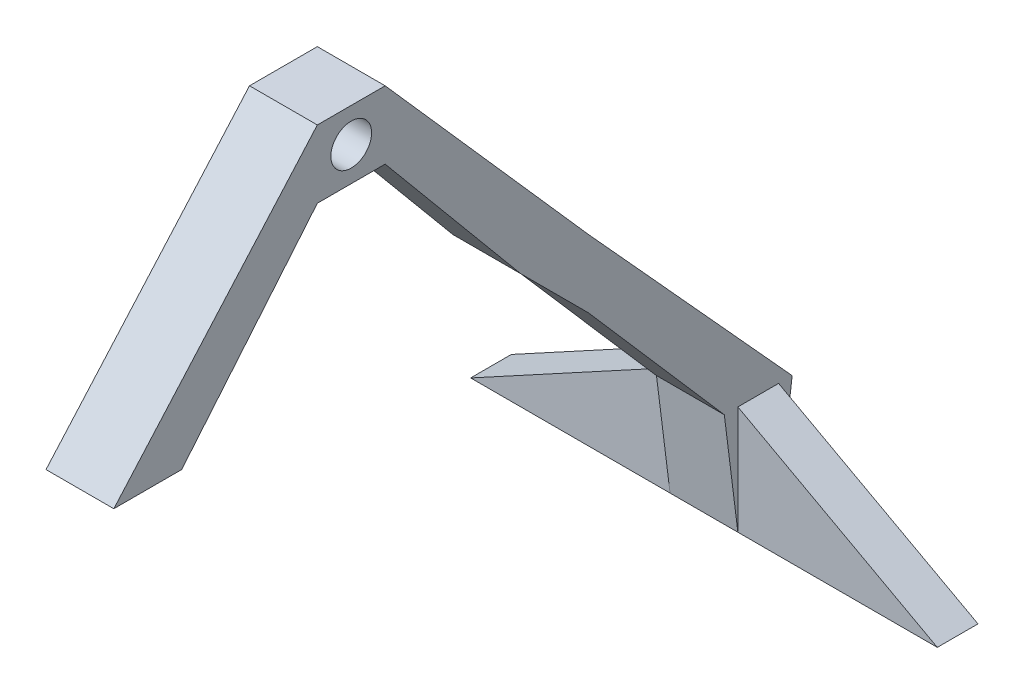
ISO-10303-21;
HEADER;
FILE_DESCRIPTION(('STEP AP214'),'2;1');
FILE_NAME('part.step','',(''),(''),'','','');
FILE_SCHEMA(('AUTOMOTIVE_DESIGN { 1 0 10303 214 1 1 1 1 }'));
ENDSEC;
DATA;
#1=APPLICATION_CONTEXT('core data for automotive mechanical design processes');
#2=APPLICATION_PROTOCOL_DEFINITION('international standard','automotive_design',2000,#1);
#3=PRODUCT_CONTEXT('',#1,'mechanical');
#4=PRODUCT('Part','Part','',(#3));
#5=PRODUCT_RELATED_PRODUCT_CATEGORY('part','',(#4));
#6=PRODUCT_DEFINITION_FORMATION('','',#4);
#7=PRODUCT_DEFINITION_CONTEXT('part definition',#1,'design');
#8=PRODUCT_DEFINITION('design','',#6,#7);
#9=PRODUCT_DEFINITION_SHAPE('','',#8);
#10=(LENGTH_UNIT() NAMED_UNIT(*) SI_UNIT(.MILLI.,.METRE.));
#11=(NAMED_UNIT(*) PLANE_ANGLE_UNIT() SI_UNIT($,.RADIAN.));
#12=(NAMED_UNIT(*) SI_UNIT($,.STERADIAN.) SOLID_ANGLE_UNIT());
#13=UNCERTAINTY_MEASURE_WITH_UNIT(LENGTH_MEASURE(1.E-05),#10,'distance_accuracy_value','');
#14=(GEOMETRIC_REPRESENTATION_CONTEXT(3) GLOBAL_UNCERTAINTY_ASSIGNED_CONTEXT((#13)) GLOBAL_UNIT_ASSIGNED_CONTEXT((#10,
#11,#12)) REPRESENTATION_CONTEXT('',''));
#15=CARTESIAN_POINT('',(0.,0.,0.));
#16=DIRECTION('',(0.,0.,1.));
#17=DIRECTION('',(1.,0.,0.));
#18=AXIS2_PLACEMENT_3D('',#15,#16,#17);
#19=CARTESIAN_POINT('',(0.,0.,0.));
#20=DIRECTION('',(0.,1.,0.));
#21=DIRECTION('',(0.,0.,1.));
#22=AXIS2_PLACEMENT_3D('',#19,#20,#21);
#23=PLANE('',#22);
#24=DIRECTION('',(-1.,0.,0.));
#25=VECTOR('',#24,1.);
#26=CARTESIAN_POINT('',(86.0010000000001,0.,7.5));
#27=LINE('',#26,#25);
#28=CARTESIAN_POINT('',(12.5000000000001,0.,7.5));
#29=VERTEX_POINT('',#28);
#30=CARTESIAN_POINT('',(-12.4999999999999,0.,7.5));
#31=VERTEX_POINT('',#30);
#32=EDGE_CURVE('E344',#29,#31,#27,.T.);
#33=ORIENTED_EDGE('',*,*,#32,.T.);
#34=DIRECTION('',(1.,0.,0.));
#35=VECTOR('',#34,1.);
#36=CARTESIAN_POINT('',(0.,0.,7.5));
#37=LINE('',#36,#35);
#38=CARTESIAN_POINT('',(-85.9999999999999,0.,7.5));
#39=VERTEX_POINT('',#38);
#40=EDGE_CURVE('E360',#39,#31,#37,.T.);
#41=ORIENTED_EDGE('',*,*,#40,.F.);
#42=DIRECTION('',(0.,0.,1.));
#43=VECTOR('',#42,1.);
#44=CARTESIAN_POINT('',(-85.9999999999999,0.,0.));
#45=LINE('',#44,#43);
#46=CARTESIAN_POINT('',(-85.9999999999999,0.,-7.5));
#47=VERTEX_POINT('',#46);
#48=EDGE_CURVE('E376',#47,#39,#45,.T.);
#49=ORIENTED_EDGE('',*,*,#48,.F.);
#50=DIRECTION('',(1.,0.,0.));
#51=VECTOR('',#50,1.);
#52=CARTESIAN_POINT('',(0.,0.,-7.5));
#53=LINE('',#52,#51);
#54=CARTESIAN_POINT('',(-12.4999999999999,0.,-7.5));
#55=VERTEX_POINT('',#54);
#56=EDGE_CURVE('E373',#47,#55,#53,.T.);
#57=ORIENTED_EDGE('',*,*,#56,.T.);
#58=DIRECTION('',(-1.,0.,0.));
#59=VECTOR('',#58,1.);
#60=CARTESIAN_POINT('',(86.0010000000001,0.,-7.5));
#61=LINE('',#60,#59);
#62=CARTESIAN_POINT('',(12.5000000000001,0.,-7.5));
#63=VERTEX_POINT('',#62);
#64=EDGE_CURVE('E353',#63,#55,#61,.T.);
#65=ORIENTED_EDGE('',*,*,#64,.F.);
#66=DIRECTION('',(1.,0.,0.));
#67=VECTOR('',#66,1.);
#68=CARTESIAN_POINT('',(0.,0.,-7.5));
#69=LINE('',#68,#67);
#70=CARTESIAN_POINT('',(85.9999999999999,0.,-7.5));
#71=VERTEX_POINT('',#70);
#72=EDGE_CURVE('E370',#63,#71,#69,.T.);
#73=ORIENTED_EDGE('',*,*,#72,.T.);
#74=DIRECTION('',(0.,0.,1.));
#75=VECTOR('',#74,1.);
#76=CARTESIAN_POINT('',(86.0000000000001,0.,0.));
#77=LINE('',#76,#75);
#78=CARTESIAN_POINT('',(86.0000000000001,0.,7.5));
#79=VERTEX_POINT('',#78);
#80=EDGE_CURVE('E366',#71,#79,#77,.T.);
#81=ORIENTED_EDGE('',*,*,#80,.T.);
#82=DIRECTION('',(1.,0.,0.));
#83=VECTOR('',#82,1.);
#84=CARTESIAN_POINT('',(0.,0.,7.5));
#85=LINE('',#84,#83);
#86=EDGE_CURVE('E363',#29,#79,#85,.T.);
#87=ORIENTED_EDGE('',*,*,#86,.F.);
#88=EDGE_LOOP('',(#33,#41,#49,#57,#65,#73,#81,#87));
#89=FACE_BOUND('',#88,.T.);
#90=ADVANCED_FACE('F173',(#89),#23,.F.);
#91=CARTESIAN_POINT('',(0.,40.,7.5));
#92=DIRECTION('',(0.,0.,-1.));
#93=DIRECTION('',(-1.,0.,0.));
#94=AXIS2_PLACEMENT_3D('',#91,#92,#93);
#95=PLANE('',#94);
#96=DIRECTION('',(-0.87835187550819,0.478014626126906,0.));
#97=VECTOR('',#96,1.);
#98=CARTESIAN_POINT('',(12.4999999999999,40.,7.5));
#99=LINE('',#98,#97);
#100=CARTESIAN_POINT('',(12.5000000000001,40.,7.5));
#101=VERTEX_POINT('',#100);
#102=EDGE_CURVE('E355',#79,#101,#99,.T.);
#103=ORIENTED_EDGE('',*,*,#102,.T.);
#104=DIRECTION('',(0.,-1.,0.));
#105=VECTOR('',#104,1.);
#106=CARTESIAN_POINT('',(12.5000000000001,40.,7.5));
#107=LINE('',#106,#105);
#108=EDGE_CURVE('E12',#101,#29,#107,.T.);
#109=ORIENTED_EDGE('',*,*,#108,.T.);
#110=ORIENTED_EDGE('',*,*,#86,.T.);
#111=EDGE_LOOP('',(#103,#109,#110));
#112=FACE_BOUND('',#111,.T.);
#113=ADVANCED_FACE('F175',(#112),#95,.F.);
#114=CARTESIAN_POINT('',(0.,40.,-7.5));
#115=DIRECTION('',(0.,0.,-1.));
#116=DIRECTION('',(-1.,0.,0.));
#117=AXIS2_PLACEMENT_3D('',#114,#115,#116);
#118=PLANE('',#117);
#119=DIRECTION('',(0.,-1.,0.));
#120=VECTOR('',#119,1.);
#121=CARTESIAN_POINT('',(12.5000000000001,40.,-7.5));
#122=LINE('',#121,#120);
#123=CARTESIAN_POINT('',(12.4999999999999,40.,-7.5));
#124=VERTEX_POINT('',#123);
#125=EDGE_CURVE('E182',#124,#63,#122,.T.);
#126=ORIENTED_EDGE('',*,*,#125,.F.);
#127=DIRECTION('',(0.87835187550819,-0.478014626126906,0.));
#128=VECTOR('',#127,1.);
#129=CARTESIAN_POINT('',(12.4999999999999,40.,-7.5));
#130=LINE('',#129,#128);
#131=EDGE_CURVE('E400',#124,#71,#130,.T.);
#132=ORIENTED_EDGE('',*,*,#131,.T.);
#133=ORIENTED_EDGE('',*,*,#72,.F.);
#134=EDGE_LOOP('',(#126,#132,#133));
#135=FACE_BOUND('',#134,.T.);
#136=ADVANCED_FACE('F508',(#135),#118,.T.);
#137=CARTESIAN_POINT('',(12.5000000000001,40.,0.));
#138=DIRECTION('',(-1.,0.,0.));
#139=DIRECTION('',(0.,0.,1.));
#140=AXIS2_PLACEMENT_3D('',#137,#138,#139);
#141=PLANE('',#140);
#142=DIRECTION('',(0.,-0.768221279597376,-0.64018439966448));
#143=VECTOR('',#142,1.);
#144=CARTESIAN_POINT('',(12.5,182.5,137.5));
#145=LINE('',#144,#143);
#146=CARTESIAN_POINT('',(12.5,182.5,137.5));
#147=VERTEX_POINT('',#146);
#148=CARTESIAN_POINT('',(12.5,122.5,87.5));
#149=VERTEX_POINT('',#148);
#150=EDGE_CURVE('E323',#147,#149,#145,.T.);
#151=ORIENTED_EDGE('',*,*,#150,.T.);
#152=DIRECTION('',(0.,0.707106781186547,0.707106781186548));
#153=VECTOR('',#152,1.);
#154=CARTESIAN_POINT('',(12.5000000000001,122.5,87.5));
#155=LINE('',#154,#153);
#156=CARTESIAN_POINT('',(12.5,97.5,62.5));
#157=VERTEX_POINT('',#156);
#158=EDGE_CURVE('E298',#157,#149,#155,.T.);
#159=ORIENTED_EDGE('',*,*,#158,.F.);
#160=DIRECTION('',(0.,-0.754605522163505,-0.656178714924787));
#161=VECTOR('',#160,1.);
#162=CARTESIAN_POINT('',(12.5,97.5,62.5));
#163=LINE('',#162,#161);
#164=CARTESIAN_POINT('',(12.5,40.,12.5));
#165=VERTEX_POINT('',#164);
#166=EDGE_CURVE('E333',#157,#165,#163,.T.);
#167=ORIENTED_EDGE('',*,*,#166,.T.);
#168=DIRECTION('',(0.,-0.992277876713668,-0.124034734589209));
#169=VECTOR('',#168,1.);
#170=CARTESIAN_POINT('',(12.5000000000001,40.,12.5));
#171=LINE('',#170,#169);
#172=EDGE_CURVE('E346',#165,#29,#171,.T.);
#173=ORIENTED_EDGE('',*,*,#172,.T.);
#174=ORIENTED_EDGE('',*,*,#108,.F.);
#175=DIRECTION('',(0.,0.,-1.));
#176=VECTOR('',#175,1.);
#177=CARTESIAN_POINT('',(12.4999999999999,40.,12.501));
#178=LINE('',#177,#176);
#179=EDGE_CURVE('E393',#101,#124,#178,.T.);
#180=ORIENTED_EDGE('',*,*,#179,.T.);
#181=ORIENTED_EDGE('',*,*,#125,.T.);
#182=DIRECTION('',(0.,-0.992277876713668,0.124034734589209));
#183=VECTOR('',#182,1.);
#184=CARTESIAN_POINT('',(12.5000000000001,40.,-12.5));
#185=LINE('',#184,#183);
#186=CARTESIAN_POINT('',(12.5000000000001,40.,-12.5));
#187=VERTEX_POINT('',#186);
#188=EDGE_CURVE('E349',#187,#63,#185,.T.);
#189=ORIENTED_EDGE('',*,*,#188,.F.);
#190=DIRECTION('',(0.,0.739940073395944,0.672672793996313));
#191=VECTOR('',#190,1.);
#192=CARTESIAN_POINT('',(12.5,122.5,62.5));
#193=LINE('',#192,#191);
#194=CARTESIAN_POINT('',(12.5,122.5,62.5));
#195=VERTEX_POINT('',#194);
#196=EDGE_CURVE('E336',#187,#195,#193,.T.);
#197=ORIENTED_EDGE('',*,*,#196,.T.);
#198=DIRECTION('',(0.,0.749837855365093,0.661621637086846));
#199=VECTOR('',#198,1.);
#200=CARTESIAN_POINT('',(12.5,207.5,137.5));
#201=LINE('',#200,#199);
#202=CARTESIAN_POINT('',(12.5,207.5,137.5));
#203=VERTEX_POINT('',#202);
#204=EDGE_CURVE('E319',#195,#203,#201,.T.);
#205=ORIENTED_EDGE('',*,*,#204,.T.);
#206=DIRECTION('',(0.,0.,1.));
#207=VECTOR('',#206,1.);
#208=CARTESIAN_POINT('',(12.5,207.5,137.5));
#209=LINE('',#208,#207);
#210=CARTESIAN_POINT('',(12.5,207.5,162.5));
#211=VERTEX_POINT('',#210);
#212=EDGE_CURVE('E456',#203,#211,#209,.T.);
#213=ORIENTED_EDGE('',*,*,#212,.T.);
#214=DIRECTION('',(0.,-0.749837855365093,0.661621637086846));
#215=VECTOR('',#214,1.);
#216=CARTESIAN_POINT('',(12.5,207.5,162.5));
#217=LINE('',#216,#215);
#218=CARTESIAN_POINT('',(12.5,122.5,237.5));
#219=VERTEX_POINT('',#218);
#220=EDGE_CURVE('E434',#211,#219,#217,.T.);
#221=ORIENTED_EDGE('',*,*,#220,.T.);
#222=DIRECTION('',(0.,0.,1.));
#223=VECTOR('',#222,1.);
#224=CARTESIAN_POINT('',(12.5000000000001,122.5,237.5));
#225=LINE('',#224,#223);
#226=CARTESIAN_POINT('',(12.5,122.5,212.5));
#227=VERTEX_POINT('',#226);
#228=EDGE_CURVE('E430',#227,#219,#225,.T.);
#229=ORIENTED_EDGE('',*,*,#228,.F.);
#230=DIRECTION('',(0.,0.768221279597376,-0.640184399664479));
#231=VECTOR('',#230,1.);
#232=CARTESIAN_POINT('',(12.5,182.5,162.5));
#233=LINE('',#232,#231);
#234=CARTESIAN_POINT('',(12.5,182.5,162.5));
#235=VERTEX_POINT('',#234);
#236=EDGE_CURVE('E437',#227,#235,#233,.T.);
#237=ORIENTED_EDGE('',*,*,#236,.T.);
#238=DIRECTION('',(0.,0.,-1.));
#239=VECTOR('',#238,1.);
#240=CARTESIAN_POINT('',(12.5,182.5,137.5));
#241=LINE('',#240,#239);
#242=EDGE_CURVE('E454',#235,#147,#241,.T.);
#243=ORIENTED_EDGE('',*,*,#242,.T.);
#244=EDGE_LOOP('',(#151,#159,#167,#173,#174,#180,#181,#189,#197,#205,#213,#221,#229,#237,#243));
#245=FACE_BOUND('',#244,.T.);
#246=CARTESIAN_POINT('',(12.5,195.,150.));
#247=DIRECTION('',(1.,0.,0.));
#248=DIRECTION('',(0.,0.,-1.));
#249=AXIS2_PLACEMENT_3D('',#246,#247,#248);
#250=CIRCLE('',#249,7.50000000000001);
#251=CARTESIAN_POINT('',(12.5,195.,142.5));
#252=VERTEX_POINT('',#251);
#253=EDGE_CURVE('E449',#252,#252,#250,.T.);
#254=ORIENTED_EDGE('',*,*,#253,.F.);
#255=EDGE_LOOP('',(#254));
#256=FACE_BOUND('',#255,.T.);
#257=ADVANCED_FACE('F421',(#245,#256),#141,.F.);
#258=CARTESIAN_POINT('',(-12.4999999999999,40.,0.));
#259=DIRECTION('',(-1.,0.,0.));
#260=DIRECTION('',(0.,0.,1.));
#261=AXIS2_PLACEMENT_3D('',#258,#259,#260);
#262=PLANE('',#261);
#263=DIRECTION('',(0.,-0.707106781186547,-0.707106781186548));
#264=VECTOR('',#263,1.);
#265=CARTESIAN_POINT('',(-12.4999999999999,122.5,87.5));
#266=LINE('',#265,#264);
#267=CARTESIAN_POINT('',(-12.4999999999999,122.5,87.5));
#268=VERTEX_POINT('',#267);
#269=CARTESIAN_POINT('',(-12.4999999999999,97.5,62.5));
#270=VERTEX_POINT('',#269);
#271=EDGE_CURVE('E295',#268,#270,#266,.T.);
#272=ORIENTED_EDGE('',*,*,#271,.F.);
#273=DIRECTION('',(0.,-0.768221279597376,-0.64018439966448));
#274=VECTOR('',#273,1.);
#275=CARTESIAN_POINT('',(-12.5,182.5,137.5));
#276=LINE('',#275,#274);
#277=CARTESIAN_POINT('',(-12.5,182.5,137.5));
#278=VERTEX_POINT('',#277);
#279=EDGE_CURVE('E309',#278,#268,#276,.T.);
#280=ORIENTED_EDGE('',*,*,#279,.F.);
#281=DIRECTION('',(0.,0.,-1.));
#282=VECTOR('',#281,1.);
#283=CARTESIAN_POINT('',(-12.5,182.5,137.5));
#284=LINE('',#283,#282);
#285=CARTESIAN_POINT('',(-12.5,182.5,162.5));
#286=VERTEX_POINT('',#285);
#287=EDGE_CURVE('E462',#286,#278,#284,.T.);
#288=ORIENTED_EDGE('',*,*,#287,.F.);
#289=DIRECTION('',(0.,0.768221279597376,-0.640184399664479));
#290=VECTOR('',#289,1.);
#291=CARTESIAN_POINT('',(-12.5,182.5,162.5));
#292=LINE('',#291,#290);
#293=CARTESIAN_POINT('',(-12.4999999999999,122.5,212.5));
#294=VERTEX_POINT('',#293);
#295=EDGE_CURVE('E443',#294,#286,#292,.T.);
#296=ORIENTED_EDGE('',*,*,#295,.F.);
#297=DIRECTION('',(0.,0.,-1.));
#298=VECTOR('',#297,1.);
#299=CARTESIAN_POINT('',(-12.4999999999999,122.5,237.5));
#300=LINE('',#299,#298);
#301=CARTESIAN_POINT('',(-12.4999999999999,122.5,237.5));
#302=VERTEX_POINT('',#301);
#303=EDGE_CURVE('E428',#302,#294,#300,.T.);
#304=ORIENTED_EDGE('',*,*,#303,.F.);
#305=DIRECTION('',(0.,-0.749837855365093,0.661621637086846));
#306=VECTOR('',#305,1.);
#307=CARTESIAN_POINT('',(-12.5,207.5,162.5));
#308=LINE('',#307,#306);
#309=CARTESIAN_POINT('',(-12.5,207.5,162.5));
#310=VERTEX_POINT('',#309);
#311=EDGE_CURVE('E440',#310,#302,#308,.T.);
#312=ORIENTED_EDGE('',*,*,#311,.F.);
#313=DIRECTION('',(0.,0.,1.));
#314=VECTOR('',#313,1.);
#315=CARTESIAN_POINT('',(-12.5,207.5,137.5));
#316=LINE('',#315,#314);
#317=CARTESIAN_POINT('',(-12.5,207.5,137.5));
#318=VERTEX_POINT('',#317);
#319=EDGE_CURVE('E464',#318,#310,#316,.T.);
#320=ORIENTED_EDGE('',*,*,#319,.F.);
#321=DIRECTION('',(0.,0.749837855365093,0.661621637086846));
#322=VECTOR('',#321,1.);
#323=CARTESIAN_POINT('',(-12.5,207.5,137.5));
#324=LINE('',#323,#322);
#325=CARTESIAN_POINT('',(-12.5,122.5,62.5));
#326=VERTEX_POINT('',#325);
#327=EDGE_CURVE('E318',#326,#318,#324,.T.);
#328=ORIENTED_EDGE('',*,*,#327,.F.);
#329=DIRECTION('',(0.,-0.739940073395944,-0.672672793996313));
#330=VECTOR('',#329,1.);
#331=CARTESIAN_POINT('',(-12.5,122.5,62.5));
#332=LINE('',#331,#330);
#333=CARTESIAN_POINT('',(-12.4999999999999,40.,-12.5));
#334=VERTEX_POINT('',#333);
#335=EDGE_CURVE('E302',#326,#334,#332,.T.);
#336=ORIENTED_EDGE('',*,*,#335,.T.);
#337=DIRECTION('',(0.,0.992277876713668,-0.124034734589209));
#338=VECTOR('',#337,1.);
#339=CARTESIAN_POINT('',(-12.4999999999999,40.,-12.5));
#340=LINE('',#339,#338);
#341=EDGE_CURVE('E351',#55,#334,#340,.T.);
#342=ORIENTED_EDGE('',*,*,#341,.F.);
#343=DIRECTION('',(0.,-1.,0.));
#344=VECTOR('',#343,1.);
#345=CARTESIAN_POINT('',(-12.4999999999999,40.,-7.5));
#346=LINE('',#345,#344);
#347=CARTESIAN_POINT('',(-12.4999999999999,40.,-7.5));
#348=VERTEX_POINT('',#347);
#349=EDGE_CURVE('E389',#348,#55,#346,.T.);
#350=ORIENTED_EDGE('',*,*,#349,.F.);
#351=DIRECTION('',(0.,0.,-1.));
#352=VECTOR('',#351,1.);
#353=CARTESIAN_POINT('',(-12.4999999999999,40.,12.501));
#354=LINE('',#353,#352);
#355=CARTESIAN_POINT('',(-12.4999999999999,40.,7.5));
#356=VERTEX_POINT('',#355);
#357=EDGE_CURVE('E381',#356,#348,#354,.T.);
#358=ORIENTED_EDGE('',*,*,#357,.F.);
#359=DIRECTION('',(0.,-1.,0.));
#360=VECTOR('',#359,1.);
#361=CARTESIAN_POINT('',(-12.4999999999999,40.,7.5));
#362=LINE('',#361,#360);
#363=EDGE_CURVE('E362',#356,#31,#362,.T.);
#364=ORIENTED_EDGE('',*,*,#363,.T.);
#365=DIRECTION('',(0.,0.992277876713668,0.124034734589209));
#366=VECTOR('',#365,1.);
#367=CARTESIAN_POINT('',(-12.4999999999999,40.,12.5));
#368=LINE('',#367,#366);
#369=CARTESIAN_POINT('',(-12.4999999999999,40.,12.5));
#370=VERTEX_POINT('',#369);
#371=EDGE_CURVE('E189',#31,#370,#368,.T.);
#372=ORIENTED_EDGE('',*,*,#371,.T.);
#373=DIRECTION('',(0.,0.754605522163505,0.656178714924787));
#374=VECTOR('',#373,1.);
#375=CARTESIAN_POINT('',(-12.5,97.5,62.5));
#376=LINE('',#375,#374);
#377=EDGE_CURVE('E312',#370,#270,#376,.T.);
#378=ORIENTED_EDGE('',*,*,#377,.T.);
#379=EDGE_LOOP('',(#272,#280,#288,#296,#304,#312,#320,#328,#336,#342,#350,#358,#364,#372,#378));
#380=FACE_BOUND('',#379,.T.);
#381=CARTESIAN_POINT('',(-12.5,195.,150.));
#382=DIRECTION('',(1.,0.,0.));
#383=DIRECTION('',(0.,0.,-1.));
#384=AXIS2_PLACEMENT_3D('',#381,#382,#383);
#385=CIRCLE('',#384,7.50000000000001);
#386=CARTESIAN_POINT('',(-12.5,195.,142.5));
#387=VERTEX_POINT('',#386);
#388=EDGE_CURVE('E459',#387,#387,#385,.T.);
#389=ORIENTED_EDGE('',*,*,#388,.T.);
#390=EDGE_LOOP('',(#389));
#391=FACE_BOUND('',#390,.T.);
#392=ADVANCED_FACE('F307',(#380,#391),#262,.T.);
#393=CARTESIAN_POINT('',(0.,40.,-7.5));
#394=DIRECTION('',(0.,0.,-1.));
#395=DIRECTION('',(-1.,0.,0.));
#396=AXIS2_PLACEMENT_3D('',#393,#394,#395);
#397=PLANE('',#396);
#398=DIRECTION('',(-0.87835187550819,-0.478014626126906,0.));
#399=VECTOR('',#398,1.);
#400=CARTESIAN_POINT('',(-12.4999999999999,40.,-7.5));
#401=LINE('',#400,#399);
#402=EDGE_CURVE('E197',#348,#47,#401,.T.);
#403=ORIENTED_EDGE('',*,*,#402,.F.);
#404=ORIENTED_EDGE('',*,*,#349,.T.);
#405=ORIENTED_EDGE('',*,*,#56,.F.);
#406=EDGE_LOOP('',(#403,#404,#405));
#407=FACE_BOUND('',#406,.T.);
#408=ADVANCED_FACE('F516',(#407),#397,.T.);
#409=CARTESIAN_POINT('',(0.,40.,7.5));
#410=DIRECTION('',(0.,0.,-1.));
#411=DIRECTION('',(-1.,0.,0.));
#412=AXIS2_PLACEMENT_3D('',#409,#410,#411);
#413=PLANE('',#412);
#414=ORIENTED_EDGE('',*,*,#363,.F.);
#415=DIRECTION('',(0.87835187550819,0.478014626126906,0.));
#416=VECTOR('',#415,1.);
#417=CARTESIAN_POINT('',(-12.4999999999999,40.,7.5));
#418=LINE('',#417,#416);
#419=EDGE_CURVE('E367',#39,#356,#418,.T.);
#420=ORIENTED_EDGE('',*,*,#419,.F.);
#421=ORIENTED_EDGE('',*,*,#40,.T.);
#422=EDGE_LOOP('',(#414,#420,#421));
#423=FACE_BOUND('',#422,.T.);
#424=ADVANCED_FACE('F513',(#423),#413,.F.);
#425=CARTESIAN_POINT('',(-12.4999999999999,40.,12.501));
#426=DIRECTION('',(0.478014626126906,-0.878351875508189,0.));
#427=DIRECTION('',(0.87835187550819,0.478014626126906,0.));
#428=AXIS2_PLACEMENT_3D('',#425,#426,#427);
#429=PLANE('',#428);
#430=ORIENTED_EDGE('',*,*,#419,.T.);
#431=ORIENTED_EDGE('',*,*,#357,.T.);
#432=ORIENTED_EDGE('',*,*,#402,.T.);
#433=ORIENTED_EDGE('',*,*,#48,.T.);
#434=EDGE_LOOP('',(#430,#431,#432,#433));
#435=FACE_BOUND('',#434,.T.);
#436=ADVANCED_FACE('F511',(#435),#429,.F.);
#437=CARTESIAN_POINT('',(12.4999999999999,40.,12.501));
#438=DIRECTION('',(0.478014626126906,0.878351875508189,0.));
#439=DIRECTION('',(-0.87835187550819,0.478014626126906,0.));
#440=AXIS2_PLACEMENT_3D('',#437,#438,#439);
#441=PLANE('',#440);
#442=ORIENTED_EDGE('',*,*,#80,.F.);
#443=ORIENTED_EDGE('',*,*,#131,.F.);
#444=ORIENTED_EDGE('',*,*,#179,.F.);
#445=ORIENTED_EDGE('',*,*,#102,.F.);
#446=EDGE_LOOP('',(#442,#443,#444,#445));
#447=FACE_BOUND('',#446,.T.);
#448=ADVANCED_FACE('F550',(#447),#441,.T.);
#449=CARTESIAN_POINT('',(86.0010000000001,40.,-12.5));
#450=DIRECTION('',(0.,0.124034734589209,0.992277876713668));
#451=DIRECTION('',(0.,-0.992277876713668,0.124034734589209));
#452=AXIS2_PLACEMENT_3D('',#449,#450,#451);
#453=PLANE('',#452);
#454=ORIENTED_EDGE('',*,*,#188,.T.);
#455=ORIENTED_EDGE('',*,*,#64,.T.);
#456=ORIENTED_EDGE('',*,*,#341,.T.);
#457=DIRECTION('',(1.,0.,0.));
#458=VECTOR('',#457,1.);
#459=CARTESIAN_POINT('',(0.,40.,-12.5));
#460=LINE('',#459,#458);
#461=EDGE_CURVE('E359',#334,#187,#460,.T.);
#462=ORIENTED_EDGE('',*,*,#461,.T.);
#463=EDGE_LOOP('',(#454,#455,#456,#462));
#464=FACE_BOUND('',#463,.T.);
#465=ADVANCED_FACE('F554',(#464),#453,.F.);
#466=CARTESIAN_POINT('',(86.0010000000001,40.,12.5));
#467=DIRECTION('',(0.,-0.124034734589209,0.992277876713668));
#468=DIRECTION('',(0.,-0.992277876713668,-0.124034734589209));
#469=AXIS2_PLACEMENT_3D('',#466,#467,#468);
#470=PLANE('',#469);
#471=DIRECTION('',(1.,0.,0.));
#472=VECTOR('',#471,1.);
#473=CARTESIAN_POINT('',(0.,40.,12.5));
#474=LINE('',#473,#472);
#475=EDGE_CURVE('E356',#370,#165,#474,.T.);
#476=ORIENTED_EDGE('',*,*,#475,.F.);
#477=ORIENTED_EDGE('',*,*,#371,.F.);
#478=ORIENTED_EDGE('',*,*,#32,.F.);
#479=ORIENTED_EDGE('',*,*,#172,.F.);
#480=EDGE_LOOP('',(#476,#477,#478,#479));
#481=FACE_BOUND('',#480,.T.);
#482=ADVANCED_FACE('F424',(#481),#470,.T.);
#483=CARTESIAN_POINT('',(123.995515604889,97.5,62.5));
#484=DIRECTION('',(0.,0.656178714924787,-0.754605522163505));
#485=DIRECTION('',(0.,0.754605522163505,0.656178714924787));
#486=AXIS2_PLACEMENT_3D('',#483,#484,#485);
#487=PLANE('',#486);
#488=ORIENTED_EDGE('',*,*,#166,.F.);
#489=DIRECTION('',(-1.,0.,0.));
#490=VECTOR('',#489,1.);
#491=CARTESIAN_POINT('',(123.995515604889,97.5,62.5));
#492=LINE('',#491,#490);
#493=EDGE_CURVE('E339',#157,#270,#492,.T.);
#494=ORIENTED_EDGE('',*,*,#493,.T.);
#495=ORIENTED_EDGE('',*,*,#377,.F.);
#496=ORIENTED_EDGE('',*,*,#475,.T.);
#497=EDGE_LOOP('',(#488,#494,#495,#496));
#498=FACE_BOUND('',#497,.T.);
#499=ADVANCED_FACE('F426',(#498),#487,.F.);
#500=CARTESIAN_POINT('',(123.995515604889,122.5,62.5));
#501=DIRECTION('',(0.,-0.672672793996313,0.739940073395944));
#502=DIRECTION('',(0.,-0.739940073395944,-0.672672793996313));
#503=AXIS2_PLACEMENT_3D('',#500,#501,#502);
#504=PLANE('',#503);
#505=ORIENTED_EDGE('',*,*,#196,.F.);
#506=ORIENTED_EDGE('',*,*,#461,.F.);
#507=ORIENTED_EDGE('',*,*,#335,.F.);
#508=DIRECTION('',(-1.,0.,0.));
#509=VECTOR('',#508,1.);
#510=CARTESIAN_POINT('',(123.995515604889,122.5,62.5));
#511=LINE('',#510,#509);
#512=EDGE_CURVE('E332',#195,#326,#511,.T.);
#513=ORIENTED_EDGE('',*,*,#512,.F.);
#514=EDGE_LOOP('',(#505,#506,#507,#513));
#515=FACE_BOUND('',#514,.T.);
#516=ADVANCED_FACE('F538',(#515),#504,.F.);
#517=CARTESIAN_POINT('',(-12.5,207.5,137.5));
#518=DIRECTION('',(0.,0.661621637086847,-0.749837855365093));
#519=DIRECTION('',(0.,0.749837855365093,0.661621637086847));
#520=AXIS2_PLACEMENT_3D('',#517,#518,#519);
#521=PLANE('',#520);
#522=DIRECTION('',(1.,0.,0.));
#523=VECTOR('',#522,1.);
#524=CARTESIAN_POINT('',(-12.5,207.5,137.5));
#525=LINE('',#524,#523);
#526=EDGE_CURVE('E303',#318,#203,#525,.T.);
#527=ORIENTED_EDGE('',*,*,#526,.T.);
#528=ORIENTED_EDGE('',*,*,#204,.F.);
#529=ORIENTED_EDGE('',*,*,#512,.T.);
#530=ORIENTED_EDGE('',*,*,#327,.T.);
#531=EDGE_LOOP('',(#527,#528,#529,#530));
#532=FACE_BOUND('',#531,.T.);
#533=ADVANCED_FACE('F540',(#532),#521,.T.);
#534=CARTESIAN_POINT('',(-12.5,182.5,137.5));
#535=DIRECTION('',(0.,-0.64018439966448,0.768221279597376));
#536=DIRECTION('',(0.,-0.768221279597376,-0.64018439966448));
#537=AXIS2_PLACEMENT_3D('',#534,#535,#536);
#538=PLANE('',#537);
#539=DIRECTION('',(1.,0.,0.));
#540=VECTOR('',#539,1.);
#541=CARTESIAN_POINT('',(-12.5,122.5,87.5));
#542=LINE('',#541,#540);
#543=EDGE_CURVE('E292',#268,#149,#542,.T.);
#544=ORIENTED_EDGE('',*,*,#543,.T.);
#545=ORIENTED_EDGE('',*,*,#150,.F.);
#546=DIRECTION('',(1.,0.,0.));
#547=VECTOR('',#546,1.);
#548=CARTESIAN_POINT('',(-12.5,182.5,137.5));
#549=LINE('',#548,#547);
#550=EDGE_CURVE('E316',#278,#147,#549,.T.);
#551=ORIENTED_EDGE('',*,*,#550,.F.);
#552=ORIENTED_EDGE('',*,*,#279,.T.);
#553=EDGE_LOOP('',(#544,#545,#551,#552));
#554=FACE_BOUND('',#553,.T.);
#555=ADVANCED_FACE('F314',(#554),#538,.T.);
#556=CARTESIAN_POINT('',(-12.5,207.5,137.5));
#557=DIRECTION('',(0.,1.,0.));
#558=DIRECTION('',(0.,0.,1.));
#559=AXIS2_PLACEMENT_3D('',#556,#557,#558);
#560=PLANE('',#559);
#561=DIRECTION('',(1.,0.,0.));
#562=VECTOR('',#561,1.);
#563=CARTESIAN_POINT('',(-12.5,207.5,162.5));
#564=LINE('',#563,#562);
#565=EDGE_CURVE('E467',#310,#211,#564,.T.);
#566=ORIENTED_EDGE('',*,*,#565,.T.);
#567=ORIENTED_EDGE('',*,*,#212,.F.);
#568=ORIENTED_EDGE('',*,*,#526,.F.);
#569=ORIENTED_EDGE('',*,*,#319,.T.);
#570=EDGE_LOOP('',(#566,#567,#568,#569));
#571=FACE_BOUND('',#570,.T.);
#572=ADVANCED_FACE('F491',(#571),#560,.T.);
#573=CARTESIAN_POINT('',(-12.5,182.5,137.5));
#574=DIRECTION('',(0.,-1.,0.));
#575=DIRECTION('',(0.,0.,-1.));
#576=AXIS2_PLACEMENT_3D('',#573,#574,#575);
#577=PLANE('',#576);
#578=ORIENTED_EDGE('',*,*,#550,.T.);
#579=ORIENTED_EDGE('',*,*,#242,.F.);
#580=DIRECTION('',(1.,0.,0.));
#581=VECTOR('',#580,1.);
#582=CARTESIAN_POINT('',(-12.5,182.5,162.5));
#583=LINE('',#582,#581);
#584=EDGE_CURVE('E466',#286,#235,#583,.T.);
#585=ORIENTED_EDGE('',*,*,#584,.F.);
#586=ORIENTED_EDGE('',*,*,#287,.T.);
#587=EDGE_LOOP('',(#578,#579,#585,#586));
#588=FACE_BOUND('',#587,.T.);
#589=ADVANCED_FACE('F488',(#588),#577,.T.);
#590=CARTESIAN_POINT('',(-12.5,195.,150.));
#591=DIRECTION('',(1.,0.,0.));
#592=DIRECTION('',(0.,0.,-1.));
#593=AXIS2_PLACEMENT_3D('',#590,#591,#592);
#594=CYLINDRICAL_SURFACE('',#593,7.50000000000001);
#595=ORIENTED_EDGE('',*,*,#388,.F.);
#596=EDGE_LOOP('',(#595));
#597=FACE_BOUND('',#596,.T.);
#598=ORIENTED_EDGE('',*,*,#253,.T.);
#599=EDGE_LOOP('',(#598));
#600=FACE_BOUND('',#599,.T.);
#601=ADVANCED_FACE('F490',(#597,#600),#594,.F.);
#602=CARTESIAN_POINT('',(-12.5,182.5,162.5));
#603=DIRECTION('',(0.,-0.640184399664479,-0.768221279597376));
#604=DIRECTION('',(0.,0.768221279597376,-0.64018439966448));
#605=AXIS2_PLACEMENT_3D('',#602,#603,#604);
#606=PLANE('',#605);
#607=ORIENTED_EDGE('',*,*,#584,.T.);
#608=ORIENTED_EDGE('',*,*,#236,.F.);
#609=DIRECTION('',(1.,0.,0.));
#610=VECTOR('',#609,1.);
#611=CARTESIAN_POINT('',(-12.5,122.5,212.5));
#612=LINE('',#611,#610);
#613=EDGE_CURVE('E447',#294,#227,#612,.T.);
#614=ORIENTED_EDGE('',*,*,#613,.F.);
#615=ORIENTED_EDGE('',*,*,#295,.T.);
#616=EDGE_LOOP('',(#607,#608,#614,#615));
#617=FACE_BOUND('',#616,.T.);
#618=ADVANCED_FACE('F473',(#617),#606,.T.);
#619=CARTESIAN_POINT('',(-12.5,207.5,162.5));
#620=DIRECTION('',(0.,0.661621637086846,0.749837855365093));
#621=DIRECTION('',(0.,-0.749837855365093,0.661621637086846));
#622=AXIS2_PLACEMENT_3D('',#619,#620,#621);
#623=PLANE('',#622);
#624=DIRECTION('',(1.,0.,0.));
#625=VECTOR('',#624,1.);
#626=CARTESIAN_POINT('',(-12.5,122.5,237.5));
#627=LINE('',#626,#625);
#628=EDGE_CURVE('E446',#302,#219,#627,.T.);
#629=ORIENTED_EDGE('',*,*,#628,.T.);
#630=ORIENTED_EDGE('',*,*,#220,.F.);
#631=ORIENTED_EDGE('',*,*,#565,.F.);
#632=ORIENTED_EDGE('',*,*,#311,.T.);
#633=EDGE_LOOP('',(#629,#630,#631,#632));
#634=FACE_BOUND('',#633,.T.);
#635=ADVANCED_FACE('F483',(#634),#623,.T.);
#636=CARTESIAN_POINT('',(86.0010250000001,122.5,237.5));
#637=DIRECTION('',(0.,1.,0.));
#638=DIRECTION('',(0.,0.,1.));
#639=AXIS2_PLACEMENT_3D('',#636,#637,#638);
#640=PLANE('',#639);
#641=ORIENTED_EDGE('',*,*,#228,.T.);
#642=ORIENTED_EDGE('',*,*,#628,.F.);
#643=ORIENTED_EDGE('',*,*,#303,.T.);
#644=ORIENTED_EDGE('',*,*,#613,.T.);
#645=EDGE_LOOP('',(#641,#642,#643,#644));
#646=FACE_BOUND('',#645,.T.);
#647=ADVANCED_FACE('F480',(#646),#640,.F.);
#648=CARTESIAN_POINT('',(86.0010250000001,122.5,87.5));
#649=DIRECTION('',(0.,0.707106781186548,-0.707106781186547));
#650=DIRECTION('',(0.,0.707106781186547,0.707106781186548));
#651=AXIS2_PLACEMENT_3D('',#648,#649,#650);
#652=PLANE('',#651);
#653=ORIENTED_EDGE('',*,*,#158,.T.);
#654=ORIENTED_EDGE('',*,*,#543,.F.);
#655=ORIENTED_EDGE('',*,*,#271,.T.);
#656=ORIENTED_EDGE('',*,*,#493,.F.);
#657=EDGE_LOOP('',(#653,#654,#655,#656));
#658=FACE_BOUND('',#657,.T.);
#659=ADVANCED_FACE('F294',(#658),#652,.F.);
#660=CLOSED_SHELL('',(#90,#113,#136,#257,#392,#408,#424,#436,#448,#465,#482,#499,#516,#533,#555,
#572,#589,#601,#618,#635,#647,#659));
#661=MANIFOLD_SOLID_BREP('B2',#660);
#662=ADVANCED_BREP_SHAPE_REPRESENTATION('',(#18,#661),#14);
#663=SHAPE_DEFINITION_REPRESENTATION(#9,#662);
ENDSEC;
END-ISO-10303-21;
